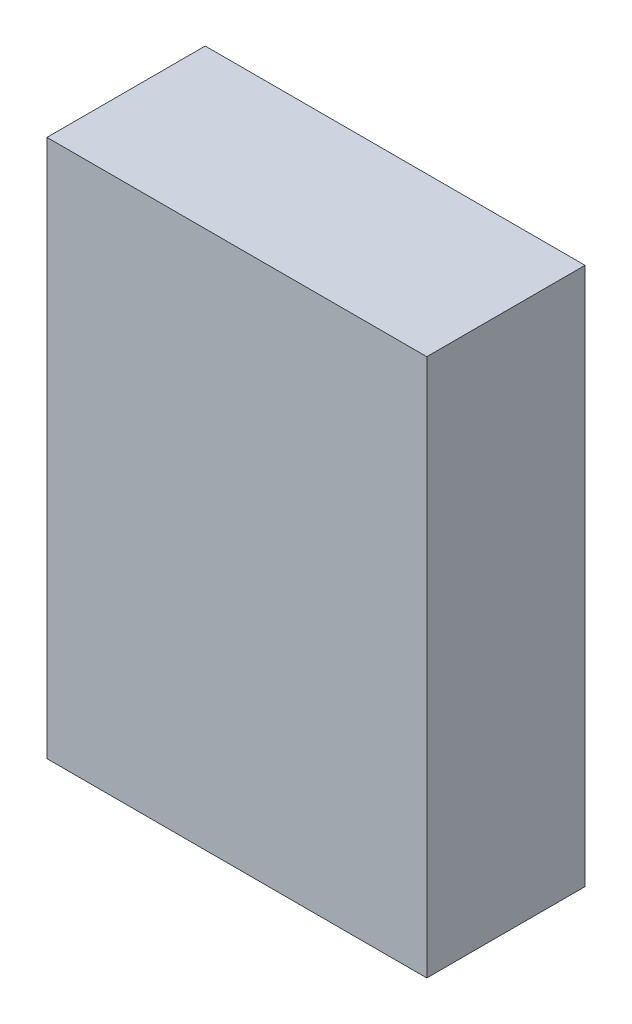
ISO-10303-21;
HEADER;
FILE_DESCRIPTION(('STEP AP214'),'2;1');
FILE_NAME('part.step','',(''),(''),'','','');
FILE_SCHEMA(('AUTOMOTIVE_DESIGN { 1 0 10303 214 1 1 1 1 }'));
ENDSEC;
DATA;
#1=APPLICATION_CONTEXT('core data for automotive mechanical design processes');
#2=APPLICATION_PROTOCOL_DEFINITION('international standard','automotive_design',2000,#1);
#3=PRODUCT_CONTEXT('',#1,'mechanical');
#4=PRODUCT('Part','Part','',(#3));
#5=PRODUCT_RELATED_PRODUCT_CATEGORY('part','',(#4));
#6=PRODUCT_DEFINITION_FORMATION('','',#4);
#7=PRODUCT_DEFINITION_CONTEXT('part definition',#1,'design');
#8=PRODUCT_DEFINITION('design','',#6,#7);
#9=PRODUCT_DEFINITION_SHAPE('','',#8);
#10=(LENGTH_UNIT() NAMED_UNIT(*) SI_UNIT(.MILLI.,.METRE.));
#11=(NAMED_UNIT(*) PLANE_ANGLE_UNIT() SI_UNIT($,.RADIAN.));
#12=(NAMED_UNIT(*) SI_UNIT($,.STERADIAN.) SOLID_ANGLE_UNIT());
#13=UNCERTAINTY_MEASURE_WITH_UNIT(LENGTH_MEASURE(1.E-05),#10,'distance_accuracy_value','');
#14=(GEOMETRIC_REPRESENTATION_CONTEXT(3) GLOBAL_UNCERTAINTY_ASSIGNED_CONTEXT((#13)) GLOBAL_UNIT_ASSIGNED_CONTEXT((#10,
#11,#12)) REPRESENTATION_CONTEXT('',''));
#15=CARTESIAN_POINT('',(0.,0.,0.));
#16=DIRECTION('',(0.,0.,1.));
#17=DIRECTION('',(1.,0.,0.));
#18=AXIS2_PLACEMENT_3D('',#15,#16,#17);
#19=CARTESIAN_POINT('',(2.13,-2.92,0.));
#20=DIRECTION('',(1.,0.,0.));
#21=DIRECTION('',(0.,0.,1.));
#22=AXIS2_PLACEMENT_3D('',#19,#20,#21);
#23=PLANE('',#22);
#24=DIRECTION('',(0.,1.,0.));
#25=VECTOR('',#24,1.);
#26=CARTESIAN_POINT('',(2.13,-2.92,0.1));
#27=LINE('',#26,#25);
#28=CARTESIAN_POINT('',(2.13,-2.92,0.1));
#29=VERTEX_POINT('',#28);
#30=CARTESIAN_POINT('',(2.13,-2.58,0.1));
#31=VERTEX_POINT('',#30);
#32=EDGE_CURVE('E11',#29,#31,#27,.T.);
#33=ORIENTED_EDGE('',*,*,#32,.T.);
#34=DIRECTION('',(0.,0.,1.));
#35=VECTOR('',#34,1.);
#36=CARTESIAN_POINT('',(2.13,-2.58,0.));
#37=LINE('',#36,#35);
#38=CARTESIAN_POINT('',(2.13,-2.58,0.));
#39=VERTEX_POINT('',#38);
#40=EDGE_CURVE('E24',#39,#31,#37,.T.);
#41=ORIENTED_EDGE('',*,*,#40,.F.);
#42=DIRECTION('',(0.,1.,0.));
#43=VECTOR('',#42,1.);
#44=CARTESIAN_POINT('',(2.13,-2.92,0.));
#45=LINE('',#44,#43);
#46=CARTESIAN_POINT('',(2.13,-2.92,0.));
#47=VERTEX_POINT('',#46);
#48=EDGE_CURVE('E86',#47,#39,#45,.T.);
#49=ORIENTED_EDGE('',*,*,#48,.F.);
#50=DIRECTION('',(0.,0.,1.));
#51=VECTOR('',#50,1.);
#52=CARTESIAN_POINT('',(2.13,-2.92,0.));
#53=LINE('',#52,#51);
#54=EDGE_CURVE('E36',#47,#29,#53,.T.);
#55=ORIENTED_EDGE('',*,*,#54,.T.);
#56=EDGE_LOOP('',(#33,#41,#49,#55));
#57=FACE_BOUND('',#56,.T.);
#58=ADVANCED_FACE('F17',(#57),#23,.F.);
#59=CARTESIAN_POINT('',(2.37,-2.92,0.));
#60=DIRECTION('',(1.,0.,0.));
#61=DIRECTION('',(0.,0.,1.));
#62=AXIS2_PLACEMENT_3D('',#59,#60,#61);
#63=PLANE('',#62);
#64=DIRECTION('',(0.,0.,1.));
#65=VECTOR('',#64,1.);
#66=CARTESIAN_POINT('',(2.37,-2.92,0.));
#67=LINE('',#66,#65);
#68=CARTESIAN_POINT('',(2.37,-2.92,0.));
#69=VERTEX_POINT('',#68);
#70=CARTESIAN_POINT('',(2.37,-2.92,0.1));
#71=VERTEX_POINT('',#70);
#72=EDGE_CURVE('E83',#69,#71,#67,.T.);
#73=ORIENTED_EDGE('',*,*,#72,.F.);
#74=DIRECTION('',(0.,1.,0.));
#75=VECTOR('',#74,1.);
#76=CARTESIAN_POINT('',(2.37,-2.92,0.));
#77=LINE('',#76,#75);
#78=CARTESIAN_POINT('',(2.37,-2.58,0.));
#79=VERTEX_POINT('',#78);
#80=EDGE_CURVE('E63',#69,#79,#77,.T.);
#81=ORIENTED_EDGE('',*,*,#80,.T.);
#82=DIRECTION('',(0.,0.,1.));
#83=VECTOR('',#82,1.);
#84=CARTESIAN_POINT('',(2.37,-2.58,0.));
#85=LINE('',#84,#83);
#86=CARTESIAN_POINT('',(2.37,-2.58,0.1));
#87=VERTEX_POINT('',#86);
#88=EDGE_CURVE('E57',#79,#87,#85,.T.);
#89=ORIENTED_EDGE('',*,*,#88,.T.);
#90=DIRECTION('',(0.,1.,0.));
#91=VECTOR('',#90,1.);
#92=CARTESIAN_POINT('',(2.37,-2.92,0.1));
#93=LINE('',#92,#91);
#94=EDGE_CURVE('E60',#71,#87,#93,.T.);
#95=ORIENTED_EDGE('',*,*,#94,.F.);
#96=EDGE_LOOP('',(#73,#81,#89,#95));
#97=FACE_BOUND('',#96,.T.);
#98=ADVANCED_FACE('F59',(#97),#63,.T.);
#99=CARTESIAN_POINT('',(2.13,-2.92,0.));
#100=DIRECTION('',(0.,1.,0.));
#101=DIRECTION('',(0.,0.,1.));
#102=AXIS2_PLACEMENT_3D('',#99,#100,#101);
#103=PLANE('',#102);
#104=ORIENTED_EDGE('',*,*,#72,.T.);
#105=DIRECTION('',(1.,0.,0.));
#106=VECTOR('',#105,1.);
#107=CARTESIAN_POINT('',(2.13,-2.92,0.1));
#108=LINE('',#107,#106);
#109=EDGE_CURVE('E71',#29,#71,#108,.T.);
#110=ORIENTED_EDGE('',*,*,#109,.F.);
#111=ORIENTED_EDGE('',*,*,#54,.F.);
#112=DIRECTION('',(1.,0.,0.));
#113=VECTOR('',#112,1.);
#114=CARTESIAN_POINT('',(2.13,-2.92,0.));
#115=LINE('',#114,#113);
#116=EDGE_CURVE('E76',#47,#69,#115,.T.);
#117=ORIENTED_EDGE('',*,*,#116,.T.);
#118=EDGE_LOOP('',(#104,#110,#111,#117));
#119=FACE_BOUND('',#118,.T.);
#120=ADVANCED_FACE('F91',(#119),#103,.F.);
#121=CARTESIAN_POINT('',(2.13,-2.58,0.));
#122=DIRECTION('',(0.,1.,0.));
#123=DIRECTION('',(0.,0.,1.));
#124=AXIS2_PLACEMENT_3D('',#121,#122,#123);
#125=PLANE('',#124);
#126=DIRECTION('',(1.,0.,0.));
#127=VECTOR('',#126,1.);
#128=CARTESIAN_POINT('',(2.13,-2.58,0.));
#129=LINE('',#128,#127);
#130=EDGE_CURVE('E74',#39,#79,#129,.T.);
#131=ORIENTED_EDGE('',*,*,#130,.F.);
#132=ORIENTED_EDGE('',*,*,#40,.T.);
#133=DIRECTION('',(1.,0.,0.));
#134=VECTOR('',#133,1.);
#135=CARTESIAN_POINT('',(2.13,-2.58,0.1));
#136=LINE('',#135,#134);
#137=EDGE_CURVE('E69',#31,#87,#136,.T.);
#138=ORIENTED_EDGE('',*,*,#137,.T.);
#139=ORIENTED_EDGE('',*,*,#88,.F.);
#140=EDGE_LOOP('',(#131,#132,#138,#139));
#141=FACE_BOUND('',#140,.T.);
#142=ADVANCED_FACE('F73',(#141),#125,.T.);
#143=CARTESIAN_POINT('',(2.13,-2.92,0.));
#144=DIRECTION('',(0.,0.,1.));
#145=DIRECTION('',(1.,0.,0.));
#146=AXIS2_PLACEMENT_3D('',#143,#144,#145);
#147=PLANE('',#146);
#148=ORIENTED_EDGE('',*,*,#130,.T.);
#149=ORIENTED_EDGE('',*,*,#80,.F.);
#150=ORIENTED_EDGE('',*,*,#116,.F.);
#151=ORIENTED_EDGE('',*,*,#48,.T.);
#152=EDGE_LOOP('',(#148,#149,#150,#151));
#153=FACE_BOUND('',#152,.T.);
#154=ADVANCED_FACE('F89',(#153),#147,.F.);
#155=CARTESIAN_POINT('',(2.13,-2.92,0.1));
#156=DIRECTION('',(0.,0.,1.));
#157=DIRECTION('',(1.,0.,0.));
#158=AXIS2_PLACEMENT_3D('',#155,#156,#157);
#159=PLANE('',#158);
#160=ORIENTED_EDGE('',*,*,#32,.F.);
#161=ORIENTED_EDGE('',*,*,#109,.T.);
#162=ORIENTED_EDGE('',*,*,#94,.T.);
#163=ORIENTED_EDGE('',*,*,#137,.F.);
#164=EDGE_LOOP('',(#160,#161,#162,#163));
#165=FACE_BOUND('',#164,.T.);
#166=ADVANCED_FACE('F68',(#165),#159,.T.);
#167=CLOSED_SHELL('',(#58,#98,#120,#142,#154,#166));
#168=MANIFOLD_SOLID_BREP('B1',#167);
#169=ADVANCED_BREP_SHAPE_REPRESENTATION('',(#18,#168),#14);
#170=SHAPE_DEFINITION_REPRESENTATION(#9,#169);
ENDSEC;
END-ISO-10303-21;
